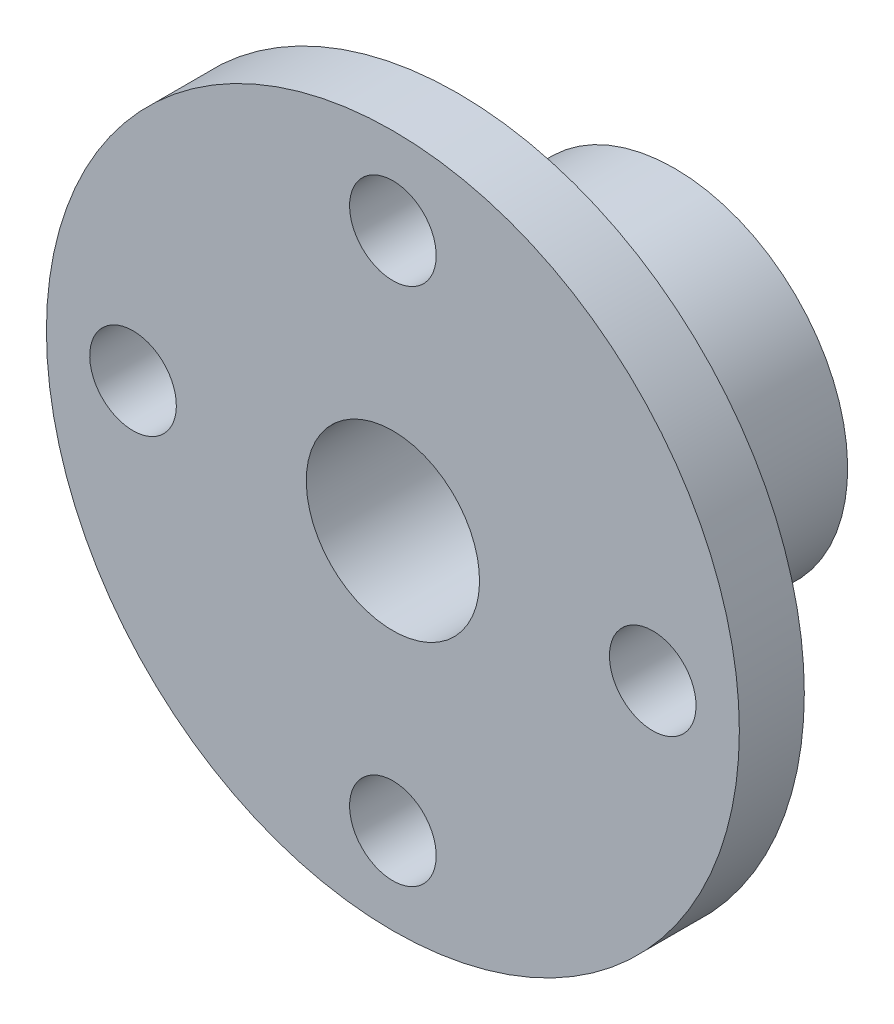
ISO-10303-21;
HEADER;
FILE_DESCRIPTION(('STEP AP214'),'2;1');
FILE_NAME('part.step','',(''),(''),'','','');
FILE_SCHEMA(('AUTOMOTIVE_DESIGN { 1 0 10303 214 1 1 1 1 }'));
ENDSEC;
DATA;
#1=APPLICATION_CONTEXT('core data for automotive mechanical design processes');
#2=APPLICATION_PROTOCOL_DEFINITION('international standard','automotive_design',2000,#1);
#3=PRODUCT_CONTEXT('',#1,'mechanical');
#4=PRODUCT('Part','Part','',(#3));
#5=PRODUCT_RELATED_PRODUCT_CATEGORY('part','',(#4));
#6=PRODUCT_DEFINITION_FORMATION('','',#4);
#7=PRODUCT_DEFINITION_CONTEXT('part definition',#1,'design');
#8=PRODUCT_DEFINITION('design','',#6,#7);
#9=PRODUCT_DEFINITION_SHAPE('','',#8);
#10=(LENGTH_UNIT() NAMED_UNIT(*) SI_UNIT(.MILLI.,.METRE.));
#11=(NAMED_UNIT(*) PLANE_ANGLE_UNIT() SI_UNIT($,.RADIAN.));
#12=(NAMED_UNIT(*) SI_UNIT($,.STERADIAN.) SOLID_ANGLE_UNIT());
#13=UNCERTAINTY_MEASURE_WITH_UNIT(LENGTH_MEASURE(1.E-05),#10,'distance_accuracy_value','');
#14=(GEOMETRIC_REPRESENTATION_CONTEXT(3) GLOBAL_UNCERTAINTY_ASSIGNED_CONTEXT((#13)) GLOBAL_UNIT_ASSIGNED_CONTEXT((#10,
#11,#12)) REPRESENTATION_CONTEXT('',''));
#15=CARTESIAN_POINT('',(0.,0.,0.));
#16=DIRECTION('',(0.,0.,1.));
#17=DIRECTION('',(1.,0.,0.));
#18=AXIS2_PLACEMENT_3D('',#15,#16,#17);
#19=CARTESIAN_POINT('',(0.,6.49999999999343,3.50000000000003));
#20=DIRECTION('',(0.,1.88032055203902E-12,-1.));
#21=DIRECTION('',(0.,1.,1.88032055203902E-12));
#22=AXIS2_PLACEMENT_3D('',#19,#20,#21);
#23=PLANE('',#22);
#24=CARTESIAN_POINT('',(0.,6.49999999999343,3.50000000000003));
#25=DIRECTION('',(0.,1.88032055203902E-12,-1.));
#26=DIRECTION('',(0.,1.,1.88032055203902E-12));
#27=AXIS2_PLACEMENT_3D('',#24,#25,#26);
#28=CIRCLE('',#27,16.);
#29=CARTESIAN_POINT('',(0.,22.4999999999934,3.50000000003012));
#30=VERTEX_POINT('',#29);
#31=EDGE_CURVE('E10',#30,#30,#28,.T.);
#32=ORIENTED_EDGE('',*,*,#31,.T.);
#33=EDGE_LOOP('',(#32));
#34=FACE_BOUND('',#33,.T.);
#35=CARTESIAN_POINT('',(12.,6.49999999999343,3.50000000000003));
#36=DIRECTION('',(0.,1.88032055203902E-12,-1.));
#37=DIRECTION('',(0.,1.,1.88032055203902E-12));
#38=AXIS2_PLACEMENT_3D('',#35,#36,#37);
#39=CIRCLE('',#38,2.);
#40=CARTESIAN_POINT('',(12.,8.49999999999343,3.50000000000379));
#41=VERTEX_POINT('',#40);
#42=EDGE_CURVE('E51',#41,#41,#39,.T.);
#43=ORIENTED_EDGE('',*,*,#42,.F.);
#44=EDGE_LOOP('',(#43));
#45=FACE_BOUND('',#44,.T.);
#46=CARTESIAN_POINT('',(0.,18.4999999999934,3.50000000002259));
#47=DIRECTION('',(0.,1.88032055203902E-12,-1.));
#48=DIRECTION('',(0.,1.,1.88032055203902E-12));
#49=AXIS2_PLACEMENT_3D('',#46,#47,#48);
#50=CIRCLE('',#49,2.);
#51=CARTESIAN_POINT('',(0.,20.4999999999934,3.50000000002635));
#52=VERTEX_POINT('',#51);
#53=EDGE_CURVE('E57',#52,#52,#50,.T.);
#54=ORIENTED_EDGE('',*,*,#53,.F.);
#55=EDGE_LOOP('',(#54));
#56=FACE_BOUND('',#55,.T.);
#57=CARTESIAN_POINT('',(-12.,6.49999999999334,3.50000000000003));
#58=DIRECTION('',(0.,1.88032055203902E-12,-1.));
#59=DIRECTION('',(0.,1.,1.88032055203902E-12));
#60=AXIS2_PLACEMENT_3D('',#57,#58,#59);
#61=CIRCLE('',#60,2.);
#62=CARTESIAN_POINT('',(-12.,8.49999999999334,3.50000000000379));
#63=VERTEX_POINT('',#62);
#64=EDGE_CURVE('E89',#63,#63,#61,.T.);
#65=ORIENTED_EDGE('',*,*,#64,.F.);
#66=EDGE_LOOP('',(#65));
#67=FACE_BOUND('',#66,.T.);
#68=CARTESIAN_POINT('',(1.25693328198353E-13,-5.50000000000657,3.49999999997747));
#69=DIRECTION('',(0.,1.88032055203902E-12,-1.));
#70=DIRECTION('',(0.,1.,1.88032055203902E-12));
#71=AXIS2_PLACEMENT_3D('',#68,#69,#70);
#72=CIRCLE('',#71,2.);
#73=CARTESIAN_POINT('',(1.25693328198353E-13,-3.50000000000657,3.49999999998123));
#74=VERTEX_POINT('',#73);
#75=EDGE_CURVE('E84',#74,#74,#72,.T.);
#76=ORIENTED_EDGE('',*,*,#75,.F.);
#77=EDGE_LOOP('',(#76));
#78=FACE_BOUND('',#77,.T.);
#79=CARTESIAN_POINT('',(0.,6.49999999999343,3.50000000000003));
#80=DIRECTION('',(0.,1.88032055203902E-12,-1.));
#81=DIRECTION('',(0.,1.,1.88032055203902E-12));
#82=AXIS2_PLACEMENT_3D('',#79,#80,#81);
#83=CIRCLE('',#82,8.);
#84=CARTESIAN_POINT('',(0.,14.4999999999934,3.50000000001507));
#85=VERTEX_POINT('',#84);
#86=EDGE_CURVE('E66',#85,#85,#83,.F.);
#87=ORIENTED_EDGE('',*,*,#86,.T.);
#88=EDGE_LOOP('',(#87));
#89=FACE_BOUND('',#88,.T.);
#90=ADVANCED_FACE('F42',(#34,#45,#56,#67,#78,#89),#23,.T.);
#91=CARTESIAN_POINT('',(0.,6.49999999999343,3.50000000000003));
#92=DIRECTION('',(0.,-1.88032055203902E-12,1.));
#93=DIRECTION('',(0.,-1.,-1.88032055203902E-12));
#94=AXIS2_PLACEMENT_3D('',#91,#92,#93);
#95=CYLINDRICAL_SURFACE('',#94,4.);
#96=CARTESIAN_POINT('',(0.,6.49999999998779,6.50000000000003));
#97=DIRECTION('',(0.,1.88032055203902E-12,-1.));
#98=DIRECTION('',(0.,1.,1.88032055203902E-12));
#99=AXIS2_PLACEMENT_3D('',#96,#97,#98);
#100=CIRCLE('',#99,4.);
#101=CARTESIAN_POINT('',(0.,10.4999999999878,6.50000000000755));
#102=VERTEX_POINT('',#101);
#103=EDGE_CURVE('E77',#102,#102,#100,.T.);
#104=ORIENTED_EDGE('',*,*,#103,.F.);
#105=EDGE_LOOP('',(#104));
#106=FACE_BOUND('',#105,.T.);
#107=CARTESIAN_POINT('',(0.,6.50000000001223,-6.49999999999997));
#108=DIRECTION('',(0.,1.88032055203902E-12,-1.));
#109=DIRECTION('',(0.,1.,1.88032055203902E-12));
#110=AXIS2_PLACEMENT_3D('',#107,#108,#109);
#111=CIRCLE('',#110,4.);
#112=CARTESIAN_POINT('',(0.,10.5000000000122,-6.49999999999245));
#113=VERTEX_POINT('',#112);
#114=EDGE_CURVE('E119',#113,#113,#111,.T.);
#115=ORIENTED_EDGE('',*,*,#114,.T.);
#116=EDGE_LOOP('',(#115));
#117=FACE_BOUND('',#116,.T.);
#118=ADVANCED_FACE('F107',(#106,#117),#95,.F.);
#119=CARTESIAN_POINT('',(12.,6.49999999999343,3.50000000000003));
#120=DIRECTION('',(0.,-1.88032055203902E-12,1.));
#121=DIRECTION('',(0.,-1.,-1.88032055203902E-12));
#122=AXIS2_PLACEMENT_3D('',#119,#120,#121);
#123=CYLINDRICAL_SURFACE('',#122,2.);
#124=ORIENTED_EDGE('',*,*,#42,.T.);
#125=EDGE_LOOP('',(#124));
#126=FACE_BOUND('',#125,.T.);
#127=CARTESIAN_POINT('',(12.,6.49999999998779,6.50000000000003));
#128=DIRECTION('',(0.,1.88032055203902E-12,-1.));
#129=DIRECTION('',(0.,1.,1.88032055203902E-12));
#130=AXIS2_PLACEMENT_3D('',#127,#128,#129);
#131=CIRCLE('',#130,2.);
#132=CARTESIAN_POINT('',(12.,8.49999999998779,6.50000000000379));
#133=VERTEX_POINT('',#132);
#134=EDGE_CURVE('E74',#133,#133,#131,.T.);
#135=ORIENTED_EDGE('',*,*,#134,.F.);
#136=EDGE_LOOP('',(#135));
#137=FACE_BOUND('',#136,.T.);
#138=ADVANCED_FACE('F146',(#126,#137),#123,.F.);
#139=CARTESIAN_POINT('',(0.,18.4999999999934,3.50000000002259));
#140=DIRECTION('',(0.,-1.88032055203902E-12,1.));
#141=DIRECTION('',(0.,-1.,-1.88032055203902E-12));
#142=AXIS2_PLACEMENT_3D('',#139,#140,#141);
#143=CYLINDRICAL_SURFACE('',#142,2.);
#144=ORIENTED_EDGE('',*,*,#53,.T.);
#145=EDGE_LOOP('',(#144));
#146=FACE_BOUND('',#145,.T.);
#147=CARTESIAN_POINT('',(0.,18.4999999999878,6.50000000002259));
#148=DIRECTION('',(0.,1.88032055203902E-12,-1.));
#149=DIRECTION('',(0.,1.,1.88032055203902E-12));
#150=AXIS2_PLACEMENT_3D('',#147,#148,#149);
#151=CIRCLE('',#150,2.);
#152=CARTESIAN_POINT('',(0.,20.4999999999878,6.50000000002635));
#153=VERTEX_POINT('',#152);
#154=EDGE_CURVE('E70',#153,#153,#151,.T.);
#155=ORIENTED_EDGE('',*,*,#154,.F.);
#156=EDGE_LOOP('',(#155));
#157=FACE_BOUND('',#156,.T.);
#158=ADVANCED_FACE('F102',(#146,#157),#143,.F.);
#159=CARTESIAN_POINT('',(-12.,6.49999999999334,3.50000000000003));
#160=DIRECTION('',(0.,-1.88032055203902E-12,1.));
#161=DIRECTION('',(0.,-1.,-1.88032055203902E-12));
#162=AXIS2_PLACEMENT_3D('',#159,#160,#161);
#163=CYLINDRICAL_SURFACE('',#162,2.);
#164=ORIENTED_EDGE('',*,*,#64,.T.);
#165=EDGE_LOOP('',(#164));
#166=FACE_BOUND('',#165,.T.);
#167=CARTESIAN_POINT('',(-12.,6.4999999999877,6.50000000000003));
#168=DIRECTION('',(0.,1.88032055203902E-12,-1.));
#169=DIRECTION('',(0.,1.,1.88032055203902E-12));
#170=AXIS2_PLACEMENT_3D('',#167,#168,#169);
#171=CIRCLE('',#170,2.);
#172=CARTESIAN_POINT('',(-12.,8.4999999999877,6.50000000000379));
#173=VERTEX_POINT('',#172);
#174=EDGE_CURVE('E65',#173,#173,#171,.T.);
#175=ORIENTED_EDGE('',*,*,#174,.F.);
#176=EDGE_LOOP('',(#175));
#177=FACE_BOUND('',#176,.T.);
#178=ADVANCED_FACE('F152',(#166,#177),#163,.F.);
#179=CARTESIAN_POINT('',(1.25693328198353E-13,-5.50000000000657,3.49999999997747));
#180=DIRECTION('',(0.,-1.88032055203902E-12,1.));
#181=DIRECTION('',(0.,-1.,-1.88032055203902E-12));
#182=AXIS2_PLACEMENT_3D('',#179,#180,#181);
#183=CYLINDRICAL_SURFACE('',#182,2.);
#184=ORIENTED_EDGE('',*,*,#75,.T.);
#185=EDGE_LOOP('',(#184));
#186=FACE_BOUND('',#185,.T.);
#187=CARTESIAN_POINT('',(1.25693328198353E-13,-5.50000000001221,6.49999999997747));
#188=DIRECTION('',(0.,1.88032055203902E-12,-1.));
#189=DIRECTION('',(0.,1.,1.88032055203902E-12));
#190=AXIS2_PLACEMENT_3D('',#187,#188,#189);
#191=CIRCLE('',#190,2.);
#192=CARTESIAN_POINT('',(1.25693328198353E-13,-3.50000000001221,6.49999999998123));
#193=VERTEX_POINT('',#192);
#194=EDGE_CURVE('E61',#193,#193,#191,.T.);
#195=ORIENTED_EDGE('',*,*,#194,.F.);
#196=EDGE_LOOP('',(#195));
#197=FACE_BOUND('',#196,.T.);
#198=ADVANCED_FACE('F44',(#186,#197),#183,.F.);
#199=CARTESIAN_POINT('',(0.,6.49999999999343,3.50000000000003));
#200=DIRECTION('',(0.,-1.88032055203902E-12,1.));
#201=DIRECTION('',(0.,-1.,-1.88032055203902E-12));
#202=AXIS2_PLACEMENT_3D('',#199,#200,#201);
#203=CYLINDRICAL_SURFACE('',#202,16.);
#204=ORIENTED_EDGE('',*,*,#31,.F.);
#205=EDGE_LOOP('',(#204));
#206=FACE_BOUND('',#205,.T.);
#207=CARTESIAN_POINT('',(0.,6.49999999998779,6.50000000000003));
#208=DIRECTION('',(0.,1.88032055203902E-12,-1.));
#209=DIRECTION('',(0.,1.,1.88032055203902E-12));
#210=AXIS2_PLACEMENT_3D('',#207,#208,#209);
#211=CIRCLE('',#210,16.);
#212=CARTESIAN_POINT('',(0.,22.4999999999878,6.50000000003012));
#213=VERTEX_POINT('',#212);
#214=EDGE_CURVE('E46',#213,#213,#211,.T.);
#215=ORIENTED_EDGE('',*,*,#214,.T.);
#216=EDGE_LOOP('',(#215));
#217=FACE_BOUND('',#216,.T.);
#218=ADVANCED_FACE('F138',(#206,#217),#203,.T.);
#219=CARTESIAN_POINT('',(0.,6.49999999998779,6.50000000000003));
#220=DIRECTION('',(0.,1.88032055203902E-12,-1.));
#221=DIRECTION('',(0.,1.,1.88032055203902E-12));
#222=AXIS2_PLACEMENT_3D('',#219,#220,#221);
#223=PLANE('',#222);
#224=ORIENTED_EDGE('',*,*,#103,.T.);
#225=EDGE_LOOP('',(#224));
#226=FACE_BOUND('',#225,.T.);
#227=ORIENTED_EDGE('',*,*,#214,.F.);
#228=EDGE_LOOP('',(#227));
#229=FACE_BOUND('',#228,.T.);
#230=ORIENTED_EDGE('',*,*,#134,.T.);
#231=EDGE_LOOP('',(#230));
#232=FACE_BOUND('',#231,.T.);
#233=ORIENTED_EDGE('',*,*,#154,.T.);
#234=EDGE_LOOP('',(#233));
#235=FACE_BOUND('',#234,.T.);
#236=ORIENTED_EDGE('',*,*,#174,.T.);
#237=EDGE_LOOP('',(#236));
#238=FACE_BOUND('',#237,.T.);
#239=ORIENTED_EDGE('',*,*,#194,.T.);
#240=EDGE_LOOP('',(#239));
#241=FACE_BOUND('',#240,.T.);
#242=ADVANCED_FACE('F131',(#226,#229,#232,#235,#238,#241),#223,.F.);
#243=CARTESIAN_POINT('',(0.,6.50000000001223,-6.49999999999997));
#244=DIRECTION('',(0.,1.88032055203902E-12,-1.));
#245=DIRECTION('',(0.,1.,1.88032055203902E-12));
#246=AXIS2_PLACEMENT_3D('',#243,#244,#245);
#247=PLANE('',#246);
#248=CARTESIAN_POINT('',(0.,6.50000000001223,-6.49999999999997));
#249=DIRECTION('',(0.,1.88032055203902E-12,-1.));
#250=DIRECTION('',(0.,1.,1.88032055203902E-12));
#251=AXIS2_PLACEMENT_3D('',#248,#249,#250);
#252=CIRCLE('',#251,8.);
#253=CARTESIAN_POINT('',(0.,14.5000000000122,-6.49999999998493));
#254=VERTEX_POINT('',#253);
#255=EDGE_CURVE('E116',#254,#254,#252,.T.);
#256=ORIENTED_EDGE('',*,*,#255,.T.);
#257=EDGE_LOOP('',(#256));
#258=FACE_BOUND('',#257,.T.);
#259=ORIENTED_EDGE('',*,*,#114,.F.);
#260=EDGE_LOOP('',(#259));
#261=FACE_BOUND('',#260,.T.);
#262=ADVANCED_FACE('F128',(#258,#261),#247,.T.);
#263=CARTESIAN_POINT('',(0.,6.50000000001223,-6.49999999999997));
#264=DIRECTION('',(0.,-1.88032055203902E-12,1.));
#265=DIRECTION('',(0.,-1.,-1.88032055203902E-12));
#266=AXIS2_PLACEMENT_3D('',#263,#264,#265);
#267=CYLINDRICAL_SURFACE('',#266,8.);
#268=ORIENTED_EDGE('',*,*,#86,.F.);
#269=EDGE_LOOP('',(#268));
#270=FACE_BOUND('',#269,.T.);
#271=ORIENTED_EDGE('',*,*,#255,.F.);
#272=EDGE_LOOP('',(#271));
#273=FACE_BOUND('',#272,.T.);
#274=ADVANCED_FACE('F130',(#270,#273),#267,.T.);
#275=CLOSED_SHELL('',(#90,#118,#138,#158,#178,#198,#218,#242,#262,#274));
#276=MANIFOLD_SOLID_BREP('B2',#275);
#277=ADVANCED_BREP_SHAPE_REPRESENTATION('',(#18,#276),#14);
#278=SHAPE_DEFINITION_REPRESENTATION(#9,#277);
ENDSEC;
END-ISO-10303-21;
